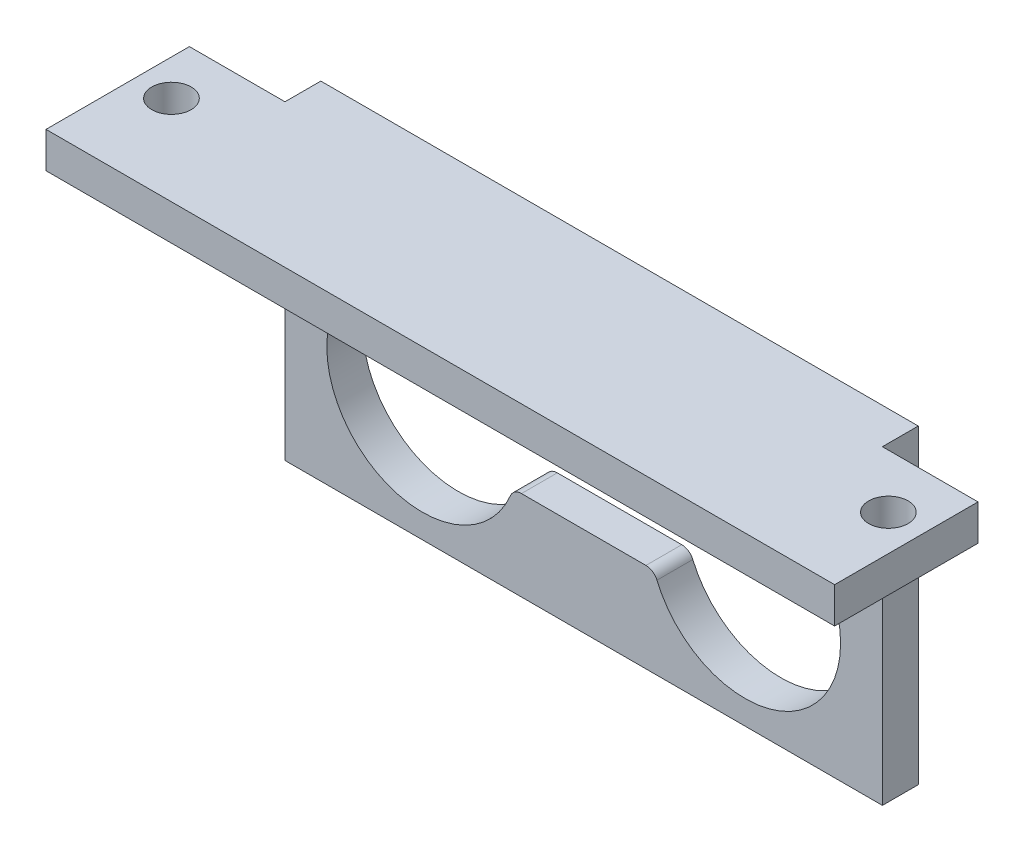
ISO-10303-21;
HEADER;
FILE_DESCRIPTION(('STEP AP214'),'2;1');
FILE_NAME('part.step','',(''),(''),'','','');
FILE_SCHEMA(('AUTOMOTIVE_DESIGN { 1 0 10303 214 1 1 1 1 }'));
ENDSEC;
DATA;
#1=APPLICATION_CONTEXT('core data for automotive mechanical design processes');
#2=APPLICATION_PROTOCOL_DEFINITION('international standard','automotive_design',2000,#1);
#3=PRODUCT_CONTEXT('',#1,'mechanical');
#4=PRODUCT('Part','Part','',(#3));
#5=PRODUCT_RELATED_PRODUCT_CATEGORY('part','',(#4));
#6=PRODUCT_DEFINITION_FORMATION('','',#4);
#7=PRODUCT_DEFINITION_CONTEXT('part definition',#1,'design');
#8=PRODUCT_DEFINITION('design','',#6,#7);
#9=PRODUCT_DEFINITION_SHAPE('','',#8);
#10=(LENGTH_UNIT() NAMED_UNIT(*) SI_UNIT(.MILLI.,.METRE.));
#11=(NAMED_UNIT(*) PLANE_ANGLE_UNIT() SI_UNIT($,.RADIAN.));
#12=(NAMED_UNIT(*) SI_UNIT($,.STERADIAN.) SOLID_ANGLE_UNIT());
#13=UNCERTAINTY_MEASURE_WITH_UNIT(LENGTH_MEASURE(1.E-05),#10,'distance_accuracy_value','');
#14=(GEOMETRIC_REPRESENTATION_CONTEXT(3) GLOBAL_UNCERTAINTY_ASSIGNED_CONTEXT((#13)) GLOBAL_UNIT_ASSIGNED_CONTEXT((#10,
#11,#12)) REPRESENTATION_CONTEXT('',''));
#15=CARTESIAN_POINT('',(0.,0.,0.));
#16=DIRECTION('',(0.,0.,1.));
#17=DIRECTION('',(1.,0.,0.));
#18=AXIS2_PLACEMENT_3D('',#15,#16,#17);
#19=CARTESIAN_POINT('',(25.,-10.,3.));
#20=DIRECTION('',(-1.,0.,0.));
#21=DIRECTION('',(0.,0.,1.));
#22=AXIS2_PLACEMENT_3D('',#19,#20,#21);
#23=PLANE('',#22);
#24=DIRECTION('',(0.,1.,0.));
#25=VECTOR('',#24,1.);
#26=CARTESIAN_POINT('',(25.,13.,3.));
#27=LINE('',#26,#25);
#28=CARTESIAN_POINT('',(25.,13.,3.));
#29=VERTEX_POINT('',#28);
#30=CARTESIAN_POINT('',(25.,16.,3.));
#31=VERTEX_POINT('',#30);
#32=EDGE_CURVE('E219',#29,#31,#27,.T.);
#33=ORIENTED_EDGE('',*,*,#32,.F.);
#34=DIRECTION('',(0.,1.,0.));
#35=VECTOR('',#34,1.);
#36=CARTESIAN_POINT('',(25.,-10.,3.));
#37=LINE('',#36,#35);
#38=CARTESIAN_POINT('',(25.,-10.,3.));
#39=VERTEX_POINT('',#38);
#40=EDGE_CURVE('E213',#39,#29,#37,.T.);
#41=ORIENTED_EDGE('',*,*,#40,.F.);
#42=DIRECTION('',(0.,0.,-1.));
#43=VECTOR('',#42,1.);
#44=CARTESIAN_POINT('',(25.,-10.,3.));
#45=LINE('',#44,#43);
#46=CARTESIAN_POINT('',(25.,-10.,0.));
#47=VERTEX_POINT('',#46);
#48=EDGE_CURVE('E45',#39,#47,#45,.T.);
#49=ORIENTED_EDGE('',*,*,#48,.T.);
#50=DIRECTION('',(0.,1.,0.));
#51=VECTOR('',#50,1.);
#52=CARTESIAN_POINT('',(25.,-10.,0.));
#53=LINE('',#52,#51);
#54=CARTESIAN_POINT('',(25.,16.,0.));
#55=VERTEX_POINT('',#54);
#56=EDGE_CURVE('E207',#47,#55,#53,.T.);
#57=ORIENTED_EDGE('',*,*,#56,.T.);
#58=DIRECTION('',(0.,0.,-1.));
#59=VECTOR('',#58,1.);
#60=CARTESIAN_POINT('',(25.,16.,0.));
#61=LINE('',#60,#59);
#62=EDGE_CURVE('E224',#31,#55,#61,.T.);
#63=ORIENTED_EDGE('',*,*,#62,.F.);
#64=EDGE_LOOP('',(#33,#41,#49,#57,#63));
#65=FACE_BOUND('',#64,.T.);
#66=ADVANCED_FACE('F37',(#65),#23,.F.);
#67=CARTESIAN_POINT('',(-25.,16.,15.));
#68=DIRECTION('',(0.,0.,-1.));
#69=DIRECTION('',(-1.,0.,0.));
#70=AXIS2_PLACEMENT_3D('',#67,#68,#69);
#71=PLANE('',#70);
#72=DIRECTION('',(-1.,0.,0.));
#73=VECTOR('',#72,1.);
#74=CARTESIAN_POINT('',(25.,13.,15.));
#75=LINE('',#74,#73);
#76=CARTESIAN_POINT('',(33.,13.,15.));
#77=VERTEX_POINT('',#76);
#78=CARTESIAN_POINT('',(-33.,13.,15.));
#79=VERTEX_POINT('',#78);
#80=EDGE_CURVE('E215',#77,#79,#75,.T.);
#81=ORIENTED_EDGE('',*,*,#80,.F.);
#82=DIRECTION('',(0.,1.,0.));
#83=VECTOR('',#82,1.);
#84=CARTESIAN_POINT('',(33.,13.,15.));
#85=LINE('',#84,#83);
#86=CARTESIAN_POINT('',(33.,16.,15.));
#87=VERTEX_POINT('',#86);
#88=EDGE_CURVE('E346',#77,#87,#85,.T.);
#89=ORIENTED_EDGE('',*,*,#88,.T.);
#90=DIRECTION('',(1.,0.,0.));
#91=VECTOR('',#90,1.);
#92=CARTESIAN_POINT('',(-25.,16.,15.));
#93=LINE('',#92,#91);
#94=CARTESIAN_POINT('',(-33.,16.,15.));
#95=VERTEX_POINT('',#94);
#96=EDGE_CURVE('E217',#95,#87,#93,.T.);
#97=ORIENTED_EDGE('',*,*,#96,.F.);
#98=DIRECTION('',(0.,1.,0.));
#99=VECTOR('',#98,1.);
#100=CARTESIAN_POINT('',(-33.,13.,15.));
#101=LINE('',#100,#99);
#102=EDGE_CURVE('E366',#79,#95,#101,.T.);
#103=ORIENTED_EDGE('',*,*,#102,.F.);
#104=EDGE_LOOP('',(#81,#89,#97,#103));
#105=FACE_BOUND('',#104,.T.);
#106=ADVANCED_FACE('F401',(#105),#71,.F.);
#107=CARTESIAN_POINT('',(0.,0.,3.));
#108=DIRECTION('',(0.,0.,1.));
#109=DIRECTION('',(1.,0.,0.));
#110=AXIS2_PLACEMENT_3D('',#107,#108,#109);
#111=PLANE('',#110);
#112=DIRECTION('',(0.,-1.,0.));
#113=VECTOR('',#112,1.);
#114=CARTESIAN_POINT('',(-25.,-10.,3.));
#115=LINE('',#114,#113);
#116=CARTESIAN_POINT('',(-25.,13.,3.));
#117=VERTEX_POINT('',#116);
#118=CARTESIAN_POINT('',(-25.,-10.,3.));
#119=VERTEX_POINT('',#118);
#120=EDGE_CURVE('E203',#117,#119,#115,.T.);
#121=ORIENTED_EDGE('',*,*,#120,.T.);
#122=DIRECTION('',(1.,0.,0.));
#123=VECTOR('',#122,1.);
#124=CARTESIAN_POINT('',(25.,-10.,3.));
#125=LINE('',#124,#123);
#126=EDGE_CURVE('E206',#119,#39,#125,.T.);
#127=ORIENTED_EDGE('',*,*,#126,.T.);
#128=ORIENTED_EDGE('',*,*,#40,.T.);
#129=DIRECTION('',(1.,0.,0.));
#130=VECTOR('',#129,1.);
#131=CARTESIAN_POINT('',(25.,13.,3.));
#132=LINE('',#131,#130);
#133=EDGE_CURVE('E196',#117,#29,#132,.T.);
#134=ORIENTED_EDGE('',*,*,#133,.F.);
#135=EDGE_LOOP('',(#121,#127,#128,#134));
#136=FACE_BOUND('',#135,.T.);
#137=CARTESIAN_POINT('',(13.5,0.,3.));
#138=DIRECTION('',(0.,0.,1.));
#139=DIRECTION('',(1.,0.,0.));
#140=AXIS2_PLACEMENT_3D('',#137,#138,#139);
#141=CIRCLE('',#140,8.);
#142=CARTESIAN_POINT('',(6.12972268809911,-3.11111111111111,3.));
#143=VERTEX_POINT('',#142);
#144=CARTESIAN_POINT('',(6.12972268809911,3.11111111111111,3.));
#145=VERTEX_POINT('',#144);
#146=EDGE_CURVE('E261',#143,#145,#141,.T.);
#147=ORIENTED_EDGE('',*,*,#146,.F.);
#148=CARTESIAN_POINT('',(5.2084380241115,-3.5,3.));
#149=DIRECTION('',(0.,0.,-1.));
#150=DIRECTION('',(-1.,0.,0.));
#151=AXIS2_PLACEMENT_3D('',#148,#149,#150);
#152=CIRCLE('',#151,1.);
#153=CARTESIAN_POINT('',(5.2084380241115,-2.5,3.));
#154=VERTEX_POINT('',#153);
#155=EDGE_CURVE('E259',#154,#143,#152,.T.);
#156=ORIENTED_EDGE('',*,*,#155,.F.);
#157=DIRECTION('',(1.,0.,0.));
#158=VECTOR('',#157,1.);
#159=CARTESIAN_POINT('',(5.2084380241115,-2.5,3.));
#160=LINE('',#159,#158);
#161=CARTESIAN_POINT('',(-5.2084380241115,-2.5,3.));
#162=VERTEX_POINT('',#161);
#163=EDGE_CURVE('E275',#162,#154,#160,.T.);
#164=ORIENTED_EDGE('',*,*,#163,.F.);
#165=CARTESIAN_POINT('',(-5.2084380241115,-3.5,3.));
#166=DIRECTION('',(0.,0.,-1.));
#167=DIRECTION('',(1.,0.,0.));
#168=AXIS2_PLACEMENT_3D('',#165,#166,#167);
#169=CIRCLE('',#168,1.);
#170=CARTESIAN_POINT('',(-6.12972268809911,-3.11111111111111,3.));
#171=VERTEX_POINT('',#170);
#172=EDGE_CURVE('E272',#171,#162,#169,.T.);
#173=ORIENTED_EDGE('',*,*,#172,.F.);
#174=CARTESIAN_POINT('',(-13.5,0.,3.));
#175=DIRECTION('',(0.,0.,1.));
#176=DIRECTION('',(1.,0.,0.));
#177=AXIS2_PLACEMENT_3D('',#174,#175,#176);
#178=CIRCLE('',#177,8.);
#179=CARTESIAN_POINT('',(-6.12972268809911,3.11111111111111,3.));
#180=VERTEX_POINT('',#179);
#181=EDGE_CURVE('E270',#180,#171,#178,.T.);
#182=ORIENTED_EDGE('',*,*,#181,.F.);
#183=CARTESIAN_POINT('',(-5.2084380241115,3.5,3.));
#184=DIRECTION('',(0.,0.,-1.));
#185=DIRECTION('',(-1.,0.,0.));
#186=AXIS2_PLACEMENT_3D('',#183,#184,#185);
#187=CIRCLE('',#186,1.);
#188=CARTESIAN_POINT('',(-5.2084380241115,2.5,3.));
#189=VERTEX_POINT('',#188);
#190=EDGE_CURVE('E268',#189,#180,#187,.T.);
#191=ORIENTED_EDGE('',*,*,#190,.F.);
#192=DIRECTION('',(-1.,0.,0.));
#193=VECTOR('',#192,1.);
#194=CARTESIAN_POINT('',(-5.2084380241115,2.5,3.));
#195=LINE('',#194,#193);
#196=CARTESIAN_POINT('',(5.2084380241115,2.5,3.));
#197=VERTEX_POINT('',#196);
#198=EDGE_CURVE('E266',#197,#189,#195,.T.);
#199=ORIENTED_EDGE('',*,*,#198,.F.);
#200=CARTESIAN_POINT('',(5.2084380241115,3.5,3.));
#201=DIRECTION('',(0.,0.,-1.));
#202=DIRECTION('',(1.,0.,0.));
#203=AXIS2_PLACEMENT_3D('',#200,#201,#202);
#204=CIRCLE('',#203,1.);
#205=EDGE_CURVE('E264',#145,#197,#204,.T.);
#206=ORIENTED_EDGE('',*,*,#205,.F.);
#207=EDGE_LOOP('',(#147,#156,#164,#173,#182,#191,#199,#206));
#208=FACE_BOUND('',#207,.T.);
#209=DIRECTION('',(-1.,0.,0.));
#210=VECTOR('',#209,1.);
#211=CARTESIAN_POINT('',(3.25,9.,3.));
#212=LINE('',#211,#210);
#213=CARTESIAN_POINT('',(3.25,9.,3.));
#214=VERTEX_POINT('',#213);
#215=CARTESIAN_POINT('',(-3.25,9.,3.));
#216=VERTEX_POINT('',#215);
#217=EDGE_CURVE('E232',#214,#216,#212,.T.);
#218=ORIENTED_EDGE('',*,*,#217,.F.);
#219=CARTESIAN_POINT('',(3.25,7.25,3.));
#220=DIRECTION('',(0.,0.,1.));
#221=DIRECTION('',(1.,0.,0.));
#222=AXIS2_PLACEMENT_3D('',#219,#220,#221);
#223=CIRCLE('',#222,1.75);
#224=CARTESIAN_POINT('',(3.25,5.5,3.));
#225=VERTEX_POINT('',#224);
#226=EDGE_CURVE('E230',#225,#214,#223,.T.);
#227=ORIENTED_EDGE('',*,*,#226,.F.);
#228=DIRECTION('',(1.,0.,0.));
#229=VECTOR('',#228,1.);
#230=CARTESIAN_POINT('',(3.25,5.5,3.));
#231=LINE('',#230,#229);
#232=CARTESIAN_POINT('',(-3.25,5.5,3.));
#233=VERTEX_POINT('',#232);
#234=EDGE_CURVE('E237',#233,#225,#231,.T.);
#235=ORIENTED_EDGE('',*,*,#234,.F.);
#236=CARTESIAN_POINT('',(-3.25,7.25,3.));
#237=DIRECTION('',(0.,0.,1.));
#238=DIRECTION('',(1.,0.,0.));
#239=AXIS2_PLACEMENT_3D('',#236,#237,#238);
#240=CIRCLE('',#239,1.75);
#241=EDGE_CURVE('E235',#216,#233,#240,.T.);
#242=ORIENTED_EDGE('',*,*,#241,.F.);
#243=EDGE_LOOP('',(#218,#227,#235,#242));
#244=FACE_BOUND('',#243,.T.);
#245=ADVANCED_FACE('F210',(#136,#208,#244),#111,.T.);
#246=CARTESIAN_POINT('',(0.,0.,0.));
#247=DIRECTION('',(0.,0.,1.));
#248=DIRECTION('',(1.,0.,0.));
#249=AXIS2_PLACEMENT_3D('',#246,#247,#248);
#250=PLANE('',#249);
#251=CARTESIAN_POINT('',(5.2084380241115,-3.5,0.));
#252=DIRECTION('',(0.,0.,-1.));
#253=DIRECTION('',(-1.,0.,0.));
#254=AXIS2_PLACEMENT_3D('',#251,#252,#253);
#255=CIRCLE('',#254,1.);
#256=CARTESIAN_POINT('',(5.2084380241115,-2.5,0.));
#257=VERTEX_POINT('',#256);
#258=CARTESIAN_POINT('',(6.12972268809911,-3.11111111111111,0.));
#259=VERTEX_POINT('',#258);
#260=EDGE_CURVE('E258',#257,#259,#255,.T.);
#261=ORIENTED_EDGE('',*,*,#260,.T.);
#262=CARTESIAN_POINT('',(13.5,0.,0.));
#263=DIRECTION('',(0.,0.,1.));
#264=DIRECTION('',(1.,0.,0.));
#265=AXIS2_PLACEMENT_3D('',#262,#263,#264);
#266=CIRCLE('',#265,8.);
#267=CARTESIAN_POINT('',(6.12972268809911,3.11111111111111,0.));
#268=VERTEX_POINT('',#267);
#269=EDGE_CURVE('E280',#259,#268,#266,.T.);
#270=ORIENTED_EDGE('',*,*,#269,.T.);
#271=CARTESIAN_POINT('',(5.2084380241115,3.5,0.));
#272=DIRECTION('',(0.,0.,-1.));
#273=DIRECTION('',(1.,0.,0.));
#274=AXIS2_PLACEMENT_3D('',#271,#272,#273);
#275=CIRCLE('',#274,1.);
#276=CARTESIAN_POINT('',(5.2084380241115,2.5,0.));
#277=VERTEX_POINT('',#276);
#278=EDGE_CURVE('E283',#268,#277,#275,.T.);
#279=ORIENTED_EDGE('',*,*,#278,.T.);
#280=DIRECTION('',(-1.,0.,0.));
#281=VECTOR('',#280,1.);
#282=CARTESIAN_POINT('',(-5.2084380241115,2.5,0.));
#283=LINE('',#282,#281);
#284=CARTESIAN_POINT('',(-5.2084380241115,2.5,0.));
#285=VERTEX_POINT('',#284);
#286=EDGE_CURVE('E286',#277,#285,#283,.T.);
#287=ORIENTED_EDGE('',*,*,#286,.T.);
#288=CARTESIAN_POINT('',(-5.2084380241115,3.5,0.));
#289=DIRECTION('',(0.,0.,-1.));
#290=DIRECTION('',(-1.,0.,0.));
#291=AXIS2_PLACEMENT_3D('',#288,#289,#290);
#292=CIRCLE('',#291,1.);
#293=CARTESIAN_POINT('',(-6.12972268809911,3.11111111111111,0.));
#294=VERTEX_POINT('',#293);
#295=EDGE_CURVE('E289',#285,#294,#292,.T.);
#296=ORIENTED_EDGE('',*,*,#295,.T.);
#297=CARTESIAN_POINT('',(-13.5,0.,0.));
#298=DIRECTION('',(0.,0.,1.));
#299=DIRECTION('',(1.,0.,0.));
#300=AXIS2_PLACEMENT_3D('',#297,#298,#299);
#301=CIRCLE('',#300,8.);
#302=CARTESIAN_POINT('',(-6.12972268809911,-3.11111111111111,0.));
#303=VERTEX_POINT('',#302);
#304=EDGE_CURVE('E292',#294,#303,#301,.T.);
#305=ORIENTED_EDGE('',*,*,#304,.T.);
#306=CARTESIAN_POINT('',(-5.2084380241115,-3.5,0.));
#307=DIRECTION('',(0.,0.,-1.));
#308=DIRECTION('',(1.,0.,0.));
#309=AXIS2_PLACEMENT_3D('',#306,#307,#308);
#310=CIRCLE('',#309,1.);
#311=CARTESIAN_POINT('',(-5.2084380241115,-2.5,0.));
#312=VERTEX_POINT('',#311);
#313=EDGE_CURVE('E295',#303,#312,#310,.T.);
#314=ORIENTED_EDGE('',*,*,#313,.T.);
#315=DIRECTION('',(1.,0.,0.));
#316=VECTOR('',#315,1.);
#317=CARTESIAN_POINT('',(5.2084380241115,-2.5,0.));
#318=LINE('',#317,#316);
#319=EDGE_CURVE('E262',#312,#257,#318,.T.);
#320=ORIENTED_EDGE('',*,*,#319,.T.);
#321=EDGE_LOOP('',(#261,#270,#279,#287,#296,#305,#314,#320));
#322=FACE_BOUND('',#321,.T.);
#323=DIRECTION('',(0.,-1.,0.));
#324=VECTOR('',#323,1.);
#325=CARTESIAN_POINT('',(-25.,-10.,0.));
#326=LINE('',#325,#324);
#327=CARTESIAN_POINT('',(-25.,16.,0.));
#328=VERTEX_POINT('',#327);
#329=CARTESIAN_POINT('',(-25.,-10.,0.));
#330=VERTEX_POINT('',#329);
#331=EDGE_CURVE('E316',#328,#330,#326,.T.);
#332=ORIENTED_EDGE('',*,*,#331,.F.);
#333=DIRECTION('',(-1.,0.,0.));
#334=VECTOR('',#333,1.);
#335=CARTESIAN_POINT('',(-25.,16.,0.));
#336=LINE('',#335,#334);
#337=EDGE_CURVE('E226',#55,#328,#336,.T.);
#338=ORIENTED_EDGE('',*,*,#337,.F.);
#339=ORIENTED_EDGE('',*,*,#56,.F.);
#340=DIRECTION('',(1.,0.,0.));
#341=VECTOR('',#340,1.);
#342=CARTESIAN_POINT('',(25.,-10.,0.));
#343=LINE('',#342,#341);
#344=EDGE_CURVE('E321',#330,#47,#343,.T.);
#345=ORIENTED_EDGE('',*,*,#344,.F.);
#346=EDGE_LOOP('',(#332,#338,#339,#345));
#347=FACE_BOUND('',#346,.T.);
#348=CARTESIAN_POINT('',(3.25,7.25,0.));
#349=DIRECTION('',(0.,0.,1.));
#350=DIRECTION('',(1.,0.,0.));
#351=AXIS2_PLACEMENT_3D('',#348,#349,#350);
#352=CIRCLE('',#351,1.75);
#353=CARTESIAN_POINT('',(3.25,5.5,0.));
#354=VERTEX_POINT('',#353);
#355=CARTESIAN_POINT('',(3.25,9.,0.));
#356=VERTEX_POINT('',#355);
#357=EDGE_CURVE('E229',#354,#356,#352,.T.);
#358=ORIENTED_EDGE('',*,*,#357,.T.);
#359=DIRECTION('',(-1.,0.,0.));
#360=VECTOR('',#359,1.);
#361=CARTESIAN_POINT('',(3.25,9.,0.));
#362=LINE('',#361,#360);
#363=CARTESIAN_POINT('',(-3.25,9.,0.));
#364=VERTEX_POINT('',#363);
#365=EDGE_CURVE('E242',#356,#364,#362,.T.);
#366=ORIENTED_EDGE('',*,*,#365,.T.);
#367=CARTESIAN_POINT('',(-3.25,7.25,0.));
#368=DIRECTION('',(0.,0.,1.));
#369=DIRECTION('',(1.,0.,0.));
#370=AXIS2_PLACEMENT_3D('',#367,#368,#369);
#371=CIRCLE('',#370,1.75);
#372=CARTESIAN_POINT('',(-3.25,5.5,0.));
#373=VERTEX_POINT('',#372);
#374=EDGE_CURVE('E245',#364,#373,#371,.T.);
#375=ORIENTED_EDGE('',*,*,#374,.T.);
#376=DIRECTION('',(1.,0.,0.));
#377=VECTOR('',#376,1.);
#378=CARTESIAN_POINT('',(3.25,5.5,0.));
#379=LINE('',#378,#377);
#380=EDGE_CURVE('E233',#373,#354,#379,.T.);
#381=ORIENTED_EDGE('',*,*,#380,.T.);
#382=EDGE_LOOP('',(#358,#366,#375,#381));
#383=FACE_BOUND('',#382,.T.);
#384=ADVANCED_FACE('F331',(#322,#347,#383),#250,.F.);
#385=CARTESIAN_POINT('',(-25.,-10.,3.));
#386=DIRECTION('',(1.,0.,0.));
#387=DIRECTION('',(0.,0.,-1.));
#388=AXIS2_PLACEMENT_3D('',#385,#386,#387);
#389=PLANE('',#388);
#390=ORIENTED_EDGE('',*,*,#120,.F.);
#391=DIRECTION('',(0.,1.,0.));
#392=VECTOR('',#391,1.);
#393=CARTESIAN_POINT('',(-25.,13.,3.));
#394=LINE('',#393,#392);
#395=CARTESIAN_POINT('',(-25.,16.,3.));
#396=VERTEX_POINT('',#395);
#397=EDGE_CURVE('E178',#117,#396,#394,.T.);
#398=ORIENTED_EDGE('',*,*,#397,.T.);
#399=DIRECTION('',(0.,0.,1.));
#400=VECTOR('',#399,1.);
#401=CARTESIAN_POINT('',(-25.,16.,0.));
#402=LINE('',#401,#400);
#403=EDGE_CURVE('E214',#328,#396,#402,.T.);
#404=ORIENTED_EDGE('',*,*,#403,.F.);
#405=ORIENTED_EDGE('',*,*,#331,.T.);
#406=DIRECTION('',(0.,0.,-1.));
#407=VECTOR('',#406,1.);
#408=CARTESIAN_POINT('',(-25.,-10.,3.));
#409=LINE('',#408,#407);
#410=EDGE_CURVE('E11',#119,#330,#409,.T.);
#411=ORIENTED_EDGE('',*,*,#410,.F.);
#412=EDGE_LOOP('',(#390,#398,#404,#405,#411));
#413=FACE_BOUND('',#412,.T.);
#414=ADVANCED_FACE('F39',(#413),#389,.F.);
#415=CARTESIAN_POINT('',(25.,-10.,3.));
#416=DIRECTION('',(0.,1.,0.));
#417=DIRECTION('',(-1.,0.,0.));
#418=AXIS2_PLACEMENT_3D('',#415,#416,#417);
#419=PLANE('',#418);
#420=ORIENTED_EDGE('',*,*,#344,.T.);
#421=ORIENTED_EDGE('',*,*,#48,.F.);
#422=ORIENTED_EDGE('',*,*,#126,.F.);
#423=ORIENTED_EDGE('',*,*,#410,.T.);
#424=EDGE_LOOP('',(#420,#421,#422,#423));
#425=FACE_BOUND('',#424,.T.);
#426=ADVANCED_FACE('F408',(#425),#419,.F.);
#427=CARTESIAN_POINT('',(5.2084380241115,-3.5,3.));
#428=DIRECTION('',(0.,0.,-1.));
#429=DIRECTION('',(-1.,0.,0.));
#430=AXIS2_PLACEMENT_3D('',#427,#428,#429);
#431=CYLINDRICAL_SURFACE('',#430,1.);
#432=ORIENTED_EDGE('',*,*,#260,.F.);
#433=DIRECTION('',(0.,0.,-1.));
#434=VECTOR('',#433,1.);
#435=CARTESIAN_POINT('',(5.2084380241115,-2.5,3.));
#436=LINE('',#435,#434);
#437=EDGE_CURVE('E277',#154,#257,#436,.T.);
#438=ORIENTED_EDGE('',*,*,#437,.F.);
#439=ORIENTED_EDGE('',*,*,#155,.T.);
#440=DIRECTION('',(0.,0.,-1.));
#441=VECTOR('',#440,1.);
#442=CARTESIAN_POINT('',(6.12972268809911,-3.11111111111111,3.));
#443=LINE('',#442,#441);
#444=EDGE_CURVE('E314',#143,#259,#443,.T.);
#445=ORIENTED_EDGE('',*,*,#444,.T.);
#446=EDGE_LOOP('',(#432,#438,#439,#445));
#447=FACE_BOUND('',#446,.T.);
#448=ADVANCED_FACE('F410',(#447),#431,.T.);
#449=CARTESIAN_POINT('',(13.5,0.,3.));
#450=DIRECTION('',(0.,0.,-1.));
#451=DIRECTION('',(-1.,0.,0.));
#452=AXIS2_PLACEMENT_3D('',#449,#450,#451);
#453=CYLINDRICAL_SURFACE('',#452,8.);
#454=ORIENTED_EDGE('',*,*,#269,.F.);
#455=ORIENTED_EDGE('',*,*,#444,.F.);
#456=ORIENTED_EDGE('',*,*,#146,.T.);
#457=DIRECTION('',(0.,0.,-1.));
#458=VECTOR('',#457,1.);
#459=CARTESIAN_POINT('',(6.12972268809911,3.11111111111111,3.));
#460=LINE('',#459,#458);
#461=EDGE_CURVE('E312',#145,#268,#460,.T.);
#462=ORIENTED_EDGE('',*,*,#461,.T.);
#463=EDGE_LOOP('',(#454,#455,#456,#462));
#464=FACE_BOUND('',#463,.T.);
#465=ADVANCED_FACE('F415',(#464),#453,.F.);
#466=CARTESIAN_POINT('',(5.2084380241115,3.5,3.));
#467=DIRECTION('',(0.,0.,-1.));
#468=DIRECTION('',(-1.,0.,0.));
#469=AXIS2_PLACEMENT_3D('',#466,#467,#468);
#470=CYLINDRICAL_SURFACE('',#469,1.);
#471=ORIENTED_EDGE('',*,*,#278,.F.);
#472=ORIENTED_EDGE('',*,*,#461,.F.);
#473=ORIENTED_EDGE('',*,*,#205,.T.);
#474=DIRECTION('',(0.,0.,-1.));
#475=VECTOR('',#474,1.);
#476=CARTESIAN_POINT('',(5.2084380241115,2.5,3.));
#477=LINE('',#476,#475);
#478=EDGE_CURVE('E310',#197,#277,#477,.T.);
#479=ORIENTED_EDGE('',*,*,#478,.T.);
#480=EDGE_LOOP('',(#471,#472,#473,#479));
#481=FACE_BOUND('',#480,.T.);
#482=ADVANCED_FACE('F441',(#481),#470,.T.);
#483=CARTESIAN_POINT('',(-5.2084380241115,2.5,3.));
#484=DIRECTION('',(0.,-1.,0.));
#485=DIRECTION('',(0.,0.,-1.));
#486=AXIS2_PLACEMENT_3D('',#483,#484,#485);
#487=PLANE('',#486);
#488=ORIENTED_EDGE('',*,*,#286,.F.);
#489=ORIENTED_EDGE('',*,*,#478,.F.);
#490=ORIENTED_EDGE('',*,*,#198,.T.);
#491=DIRECTION('',(0.,0.,-1.));
#492=VECTOR('',#491,1.);
#493=CARTESIAN_POINT('',(-5.2084380241115,2.5,3.));
#494=LINE('',#493,#492);
#495=EDGE_CURVE('E308',#189,#285,#494,.T.);
#496=ORIENTED_EDGE('',*,*,#495,.T.);
#497=EDGE_LOOP('',(#488,#489,#490,#496));
#498=FACE_BOUND('',#497,.T.);
#499=ADVANCED_FACE('F446',(#498),#487,.T.);
#500=CARTESIAN_POINT('',(-5.2084380241115,3.5,3.));
#501=DIRECTION('',(0.,0.,-1.));
#502=DIRECTION('',(-1.,0.,0.));
#503=AXIS2_PLACEMENT_3D('',#500,#501,#502);
#504=CYLINDRICAL_SURFACE('',#503,1.);
#505=ORIENTED_EDGE('',*,*,#295,.F.);
#506=ORIENTED_EDGE('',*,*,#495,.F.);
#507=ORIENTED_EDGE('',*,*,#190,.T.);
#508=DIRECTION('',(0.,0.,-1.));
#509=VECTOR('',#508,1.);
#510=CARTESIAN_POINT('',(-6.12972268809911,3.11111111111111,3.));
#511=LINE('',#510,#509);
#512=EDGE_CURVE('E306',#180,#294,#511,.T.);
#513=ORIENTED_EDGE('',*,*,#512,.T.);
#514=EDGE_LOOP('',(#505,#506,#507,#513));
#515=FACE_BOUND('',#514,.T.);
#516=ADVANCED_FACE('F451',(#515),#504,.T.);
#517=CARTESIAN_POINT('',(-13.5,0.,3.));
#518=DIRECTION('',(0.,0.,-1.));
#519=DIRECTION('',(-1.,0.,0.));
#520=AXIS2_PLACEMENT_3D('',#517,#518,#519);
#521=CYLINDRICAL_SURFACE('',#520,8.);
#522=ORIENTED_EDGE('',*,*,#304,.F.);
#523=ORIENTED_EDGE('',*,*,#512,.F.);
#524=ORIENTED_EDGE('',*,*,#181,.T.);
#525=DIRECTION('',(0.,0.,-1.));
#526=VECTOR('',#525,1.);
#527=CARTESIAN_POINT('',(-6.12972268809911,-3.11111111111111,3.));
#528=LINE('',#527,#526);
#529=EDGE_CURVE('E304',#171,#303,#528,.T.);
#530=ORIENTED_EDGE('',*,*,#529,.T.);
#531=EDGE_LOOP('',(#522,#523,#524,#530));
#532=FACE_BOUND('',#531,.T.);
#533=ADVANCED_FACE('F455',(#532),#521,.F.);
#534=CARTESIAN_POINT('',(-5.2084380241115,-3.5,3.));
#535=DIRECTION('',(0.,0.,-1.));
#536=DIRECTION('',(-1.,0.,0.));
#537=AXIS2_PLACEMENT_3D('',#534,#535,#536);
#538=CYLINDRICAL_SURFACE('',#537,1.);
#539=ORIENTED_EDGE('',*,*,#313,.F.);
#540=ORIENTED_EDGE('',*,*,#529,.F.);
#541=ORIENTED_EDGE('',*,*,#172,.T.);
#542=DIRECTION('',(0.,0.,-1.));
#543=VECTOR('',#542,1.);
#544=CARTESIAN_POINT('',(-5.2084380241115,-2.5,3.));
#545=LINE('',#544,#543);
#546=EDGE_CURVE('E302',#162,#312,#545,.T.);
#547=ORIENTED_EDGE('',*,*,#546,.T.);
#548=EDGE_LOOP('',(#539,#540,#541,#547));
#549=FACE_BOUND('',#548,.T.);
#550=ADVANCED_FACE('F459',(#549),#538,.T.);
#551=CARTESIAN_POINT('',(5.2084380241115,-2.5,3.));
#552=DIRECTION('',(0.,1.,0.));
#553=DIRECTION('',(-1.,0.,0.));
#554=AXIS2_PLACEMENT_3D('',#551,#552,#553);
#555=PLANE('',#554);
#556=ORIENTED_EDGE('',*,*,#319,.F.);
#557=ORIENTED_EDGE('',*,*,#546,.F.);
#558=ORIENTED_EDGE('',*,*,#163,.T.);
#559=ORIENTED_EDGE('',*,*,#437,.T.);
#560=EDGE_LOOP('',(#556,#557,#558,#559));
#561=FACE_BOUND('',#560,.T.);
#562=ADVANCED_FACE('F430',(#561),#555,.T.);
#563=CARTESIAN_POINT('',(3.25,7.25,3.));
#564=DIRECTION('',(0.,0.,-1.));
#565=DIRECTION('',(-1.,0.,0.));
#566=AXIS2_PLACEMENT_3D('',#563,#564,#565);
#567=CYLINDRICAL_SURFACE('',#566,1.75);
#568=ORIENTED_EDGE('',*,*,#357,.F.);
#569=DIRECTION('',(0.,0.,-1.));
#570=VECTOR('',#569,1.);
#571=CARTESIAN_POINT('',(3.25,5.5,3.));
#572=LINE('',#571,#570);
#573=EDGE_CURVE('E239',#225,#354,#572,.T.);
#574=ORIENTED_EDGE('',*,*,#573,.F.);
#575=ORIENTED_EDGE('',*,*,#226,.T.);
#576=DIRECTION('',(0.,0.,-1.));
#577=VECTOR('',#576,1.);
#578=CARTESIAN_POINT('',(3.25,9.,3.));
#579=LINE('',#578,#577);
#580=EDGE_CURVE('E255',#214,#356,#579,.T.);
#581=ORIENTED_EDGE('',*,*,#580,.T.);
#582=EDGE_LOOP('',(#568,#574,#575,#581));
#583=FACE_BOUND('',#582,.T.);
#584=ADVANCED_FACE('F466',(#583),#567,.F.);
#585=CARTESIAN_POINT('',(3.25,9.,3.));
#586=DIRECTION('',(0.,-1.,0.));
#587=DIRECTION('',(1.,0.,0.));
#588=AXIS2_PLACEMENT_3D('',#585,#586,#587);
#589=PLANE('',#588);
#590=ORIENTED_EDGE('',*,*,#365,.F.);
#591=ORIENTED_EDGE('',*,*,#580,.F.);
#592=ORIENTED_EDGE('',*,*,#217,.T.);
#593=DIRECTION('',(0.,0.,-1.));
#594=VECTOR('',#593,1.);
#595=CARTESIAN_POINT('',(-3.25,9.,3.));
#596=LINE('',#595,#594);
#597=EDGE_CURVE('E253',#216,#364,#596,.T.);
#598=ORIENTED_EDGE('',*,*,#597,.T.);
#599=EDGE_LOOP('',(#590,#591,#592,#598));
#600=FACE_BOUND('',#599,.T.);
#601=ADVANCED_FACE('F517',(#600),#589,.T.);
#602=CARTESIAN_POINT('',(-3.25,7.25,3.));
#603=DIRECTION('',(0.,0.,-1.));
#604=DIRECTION('',(-1.,0.,0.));
#605=AXIS2_PLACEMENT_3D('',#602,#603,#604);
#606=CYLINDRICAL_SURFACE('',#605,1.75);
#607=ORIENTED_EDGE('',*,*,#374,.F.);
#608=ORIENTED_EDGE('',*,*,#597,.F.);
#609=ORIENTED_EDGE('',*,*,#241,.T.);
#610=DIRECTION('',(0.,0.,-1.));
#611=VECTOR('',#610,1.);
#612=CARTESIAN_POINT('',(-3.25,5.5,3.));
#613=LINE('',#612,#611);
#614=EDGE_CURVE('E60',#233,#373,#613,.T.);
#615=ORIENTED_EDGE('',*,*,#614,.T.);
#616=EDGE_LOOP('',(#607,#608,#609,#615));
#617=FACE_BOUND('',#616,.T.);
#618=ADVANCED_FACE('F397',(#617),#606,.F.);
#619=CARTESIAN_POINT('',(3.25,5.5,3.));
#620=DIRECTION('',(0.,1.,0.));
#621=DIRECTION('',(0.,0.,1.));
#622=AXIS2_PLACEMENT_3D('',#619,#620,#621);
#623=PLANE('',#622);
#624=ORIENTED_EDGE('',*,*,#380,.F.);
#625=ORIENTED_EDGE('',*,*,#614,.F.);
#626=ORIENTED_EDGE('',*,*,#234,.T.);
#627=ORIENTED_EDGE('',*,*,#573,.T.);
#628=EDGE_LOOP('',(#624,#625,#626,#627));
#629=FACE_BOUND('',#628,.T.);
#630=ADVANCED_FACE('F390',(#629),#623,.T.);
#631=CARTESIAN_POINT('',(0.,16.,0.));
#632=DIRECTION('',(0.,1.,0.));
#633=DIRECTION('',(-1.,0.,0.));
#634=AXIS2_PLACEMENT_3D('',#631,#632,#633);
#635=PLANE('',#634);
#636=ORIENTED_EDGE('',*,*,#403,.T.);
#637=DIRECTION('',(-1.,0.,0.));
#638=VECTOR('',#637,1.);
#639=CARTESIAN_POINT('',(-25.,16.,3.));
#640=LINE('',#639,#638);
#641=CARTESIAN_POINT('',(-33.,16.,3.));
#642=VERTEX_POINT('',#641);
#643=EDGE_CURVE('E52',#396,#642,#640,.T.);
#644=ORIENTED_EDGE('',*,*,#643,.T.);
#645=DIRECTION('',(0.,0.,1.));
#646=VECTOR('',#645,1.);
#647=CARTESIAN_POINT('',(-33.,16.,15.));
#648=LINE('',#647,#646);
#649=EDGE_CURVE('E199',#642,#95,#648,.T.);
#650=ORIENTED_EDGE('',*,*,#649,.T.);
#651=ORIENTED_EDGE('',*,*,#96,.T.);
#652=DIRECTION('',(0.,0.,-1.));
#653=VECTOR('',#652,1.);
#654=CARTESIAN_POINT('',(33.,16.,15.));
#655=LINE('',#654,#653);
#656=CARTESIAN_POINT('',(33.,16.,3.));
#657=VERTEX_POINT('',#656);
#658=EDGE_CURVE('E359',#87,#657,#655,.T.);
#659=ORIENTED_EDGE('',*,*,#658,.T.);
#660=DIRECTION('',(-1.,0.,0.));
#661=VECTOR('',#660,1.);
#662=CARTESIAN_POINT('',(25.,16.,3.));
#663=LINE('',#662,#661);
#664=EDGE_CURVE('E339',#657,#31,#663,.T.);
#665=ORIENTED_EDGE('',*,*,#664,.T.);
#666=ORIENTED_EDGE('',*,*,#62,.T.);
#667=ORIENTED_EDGE('',*,*,#337,.T.);
#668=EDGE_LOOP('',(#636,#644,#650,#651,#659,#665,#666,#667));
#669=FACE_BOUND('',#668,.T.);
#670=CARTESIAN_POINT('',(30.,16.,7.5));
#671=DIRECTION('',(0.,1.,0.));
#672=DIRECTION('',(-1.,0.,0.));
#673=AXIS2_PLACEMENT_3D('',#670,#671,#672);
#674=CIRCLE('',#673,1.65000000000001);
#675=CARTESIAN_POINT('',(28.35,16.,7.5));
#676=VERTEX_POINT('',#675);
#677=EDGE_CURVE('E362',#676,#676,#674,.T.);
#678=ORIENTED_EDGE('',*,*,#677,.F.);
#679=EDGE_LOOP('',(#678));
#680=FACE_BOUND('',#679,.T.);
#681=CARTESIAN_POINT('',(-30.,16.,7.5));
#682=DIRECTION('',(0.,1.,0.));
#683=DIRECTION('',(-1.,0.,0.));
#684=AXIS2_PLACEMENT_3D('',#681,#682,#683);
#685=CIRCLE('',#684,1.65);
#686=CARTESIAN_POINT('',(-31.65,16.,7.5));
#687=VERTEX_POINT('',#686);
#688=EDGE_CURVE('E376',#687,#687,#685,.T.);
#689=ORIENTED_EDGE('',*,*,#688,.F.);
#690=EDGE_LOOP('',(#689));
#691=FACE_BOUND('',#690,.T.);
#692=ADVANCED_FACE('F334',(#669,#680,#691),#635,.T.);
#693=CARTESIAN_POINT('',(0.,13.,0.));
#694=DIRECTION('',(0.,-1.,0.));
#695=DIRECTION('',(1.,0.,0.));
#696=AXIS2_PLACEMENT_3D('',#693,#694,#695);
#697=PLANE('',#696);
#698=ORIENTED_EDGE('',*,*,#133,.T.);
#699=DIRECTION('',(-1.,0.,0.));
#700=VECTOR('',#699,1.);
#701=CARTESIAN_POINT('',(25.,13.,3.));
#702=LINE('',#701,#700);
#703=CARTESIAN_POINT('',(33.,13.,3.));
#704=VERTEX_POINT('',#703);
#705=EDGE_CURVE('E343',#704,#29,#702,.T.);
#706=ORIENTED_EDGE('',*,*,#705,.F.);
#707=DIRECTION('',(0.,0.,-1.));
#708=VECTOR('',#707,1.);
#709=CARTESIAN_POINT('',(33.,13.,15.));
#710=LINE('',#709,#708);
#711=EDGE_CURVE('E354',#77,#704,#710,.T.);
#712=ORIENTED_EDGE('',*,*,#711,.F.);
#713=ORIENTED_EDGE('',*,*,#80,.T.);
#714=DIRECTION('',(0.,0.,1.));
#715=VECTOR('',#714,1.);
#716=CARTESIAN_POINT('',(-33.,13.,15.));
#717=LINE('',#716,#715);
#718=CARTESIAN_POINT('',(-33.,13.,3.));
#719=VERTEX_POINT('',#718);
#720=EDGE_CURVE('E187',#719,#79,#717,.T.);
#721=ORIENTED_EDGE('',*,*,#720,.F.);
#722=DIRECTION('',(-1.,0.,0.));
#723=VECTOR('',#722,1.);
#724=CARTESIAN_POINT('',(-25.,13.,3.));
#725=LINE('',#724,#723);
#726=EDGE_CURVE('E181',#117,#719,#725,.T.);
#727=ORIENTED_EDGE('',*,*,#726,.F.);
#728=EDGE_LOOP('',(#698,#706,#712,#713,#721,#727));
#729=FACE_BOUND('',#728,.T.);
#730=CARTESIAN_POINT('',(30.,13.,7.5));
#731=DIRECTION('',(0.,1.,0.));
#732=DIRECTION('',(-1.,0.,0.));
#733=AXIS2_PLACEMENT_3D('',#730,#731,#732);
#734=CIRCLE('',#733,1.65000000000001);
#735=CARTESIAN_POINT('',(28.35,13.,7.5));
#736=VERTEX_POINT('',#735);
#737=EDGE_CURVE('E360',#736,#736,#734,.T.);
#738=ORIENTED_EDGE('',*,*,#737,.T.);
#739=EDGE_LOOP('',(#738));
#740=FACE_BOUND('',#739,.T.);
#741=CARTESIAN_POINT('',(-30.,13.,7.5));
#742=DIRECTION('',(0.,1.,0.));
#743=DIRECTION('',(-1.,0.,0.));
#744=AXIS2_PLACEMENT_3D('',#741,#742,#743);
#745=CIRCLE('',#744,1.65);
#746=CARTESIAN_POINT('',(-31.65,13.,7.5));
#747=VERTEX_POINT('',#746);
#748=EDGE_CURVE('E374',#747,#747,#745,.T.);
#749=ORIENTED_EDGE('',*,*,#748,.T.);
#750=EDGE_LOOP('',(#749));
#751=FACE_BOUND('',#750,.T.);
#752=ADVANCED_FACE('F192',(#729,#740,#751),#697,.T.);
#753=CARTESIAN_POINT('',(25.,13.,3.));
#754=DIRECTION('',(0.,0.,-1.));
#755=DIRECTION('',(0.,1.,0.));
#756=AXIS2_PLACEMENT_3D('',#753,#754,#755);
#757=PLANE('',#756);
#758=ORIENTED_EDGE('',*,*,#664,.F.);
#759=DIRECTION('',(0.,1.,0.));
#760=VECTOR('',#759,1.);
#761=CARTESIAN_POINT('',(33.,13.,3.));
#762=LINE('',#761,#760);
#763=EDGE_CURVE('E344',#704,#657,#762,.T.);
#764=ORIENTED_EDGE('',*,*,#763,.F.);
#765=ORIENTED_EDGE('',*,*,#705,.T.);
#766=ORIENTED_EDGE('',*,*,#32,.T.);
#767=EDGE_LOOP('',(#758,#764,#765,#766));
#768=FACE_BOUND('',#767,.T.);
#769=ADVANCED_FACE('F342',(#768),#757,.T.);
#770=CARTESIAN_POINT('',(33.,13.,15.));
#771=DIRECTION('',(1.,0.,0.));
#772=DIRECTION('',(0.,1.,0.));
#773=AXIS2_PLACEMENT_3D('',#770,#771,#772);
#774=PLANE('',#773);
#775=ORIENTED_EDGE('',*,*,#658,.F.);
#776=ORIENTED_EDGE('',*,*,#88,.F.);
#777=ORIENTED_EDGE('',*,*,#711,.T.);
#778=ORIENTED_EDGE('',*,*,#763,.T.);
#779=EDGE_LOOP('',(#775,#776,#777,#778));
#780=FACE_BOUND('',#779,.T.);
#781=ADVANCED_FACE('F594',(#780),#774,.T.);
#782=CARTESIAN_POINT('',(30.,13.,7.5));
#783=DIRECTION('',(0.,1.,0.));
#784=DIRECTION('',(-1.,0.,0.));
#785=AXIS2_PLACEMENT_3D('',#782,#783,#784);
#786=CYLINDRICAL_SURFACE('',#785,1.65000000000001);
#787=ORIENTED_EDGE('',*,*,#737,.F.);
#788=EDGE_LOOP('',(#787));
#789=FACE_BOUND('',#788,.T.);
#790=ORIENTED_EDGE('',*,*,#677,.T.);
#791=EDGE_LOOP('',(#790));
#792=FACE_BOUND('',#791,.T.);
#793=ADVANCED_FACE('F603',(#789,#792),#786,.F.);
#794=CARTESIAN_POINT('',(-33.,13.,15.));
#795=DIRECTION('',(-1.,0.,0.));
#796=DIRECTION('',(0.,-1.,0.));
#797=AXIS2_PLACEMENT_3D('',#794,#795,#796);
#798=PLANE('',#797);
#799=ORIENTED_EDGE('',*,*,#649,.F.);
#800=DIRECTION('',(0.,1.,0.));
#801=VECTOR('',#800,1.);
#802=CARTESIAN_POINT('',(-33.,13.,3.));
#803=LINE('',#802,#801);
#804=EDGE_CURVE('E186',#719,#642,#803,.T.);
#805=ORIENTED_EDGE('',*,*,#804,.F.);
#806=ORIENTED_EDGE('',*,*,#720,.T.);
#807=ORIENTED_EDGE('',*,*,#102,.T.);
#808=EDGE_LOOP('',(#799,#805,#806,#807));
#809=FACE_BOUND('',#808,.T.);
#810=ADVANCED_FACE('F613',(#809),#798,.T.);
#811=CARTESIAN_POINT('',(-25.,13.,3.));
#812=DIRECTION('',(0.,0.,-1.));
#813=DIRECTION('',(-1.,0.,0.));
#814=AXIS2_PLACEMENT_3D('',#811,#812,#813);
#815=PLANE('',#814);
#816=ORIENTED_EDGE('',*,*,#643,.F.);
#817=ORIENTED_EDGE('',*,*,#397,.F.);
#818=ORIENTED_EDGE('',*,*,#726,.T.);
#819=ORIENTED_EDGE('',*,*,#804,.T.);
#820=EDGE_LOOP('',(#816,#817,#818,#819));
#821=FACE_BOUND('',#820,.T.);
#822=ADVANCED_FACE('F180',(#821),#815,.T.);
#823=CARTESIAN_POINT('',(-30.,13.,7.5));
#824=DIRECTION('',(0.,1.,0.));
#825=DIRECTION('',(-1.,0.,0.));
#826=AXIS2_PLACEMENT_3D('',#823,#824,#825);
#827=CYLINDRICAL_SURFACE('',#826,1.65);
#828=ORIENTED_EDGE('',*,*,#748,.F.);
#829=EDGE_LOOP('',(#828));
#830=FACE_BOUND('',#829,.T.);
#831=ORIENTED_EDGE('',*,*,#688,.T.);
#832=EDGE_LOOP('',(#831));
#833=FACE_BOUND('',#832,.T.);
#834=ADVANCED_FACE('F383',(#830,#833),#827,.F.);
#835=CLOSED_SHELL('',(#66,#106,#245,#384,#414,#426,#448,#465,#482,#499,#516,#533,#550,#562,#584,
#601,#618,#630,#692,#752,#769,#781,#793,#810,#822,#834));
#836=MANIFOLD_SOLID_BREP('B2',#835);
#837=ADVANCED_BREP_SHAPE_REPRESENTATION('',(#18,#836),#14);
#838=SHAPE_DEFINITION_REPRESENTATION(#9,#837);
ENDSEC;
END-ISO-10303-21;
